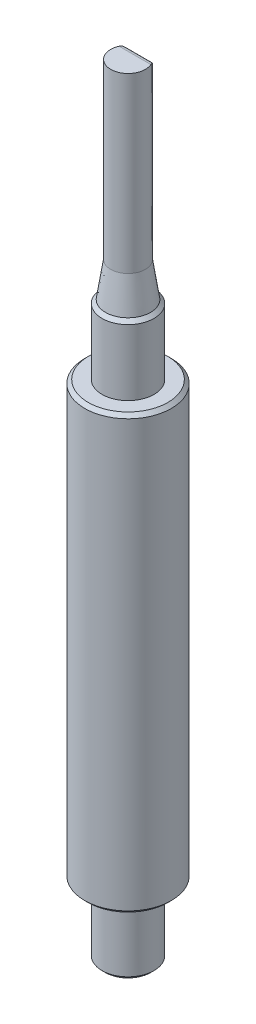
ISO-10303-21;
HEADER;
FILE_DESCRIPTION(('STEP AP214'),'2;1');
FILE_NAME('part.step','',(''),(''),'','','');
FILE_SCHEMA(('AUTOMOTIVE_DESIGN { 1 0 10303 214 1 1 1 1 }'));
ENDSEC;
DATA;
#1=APPLICATION_CONTEXT('core data for automotive mechanical design processes');
#2=APPLICATION_PROTOCOL_DEFINITION('international standard','automotive_design',2000,#1);
#3=PRODUCT_CONTEXT('',#1,'mechanical');
#4=PRODUCT('Part','Part','',(#3));
#5=PRODUCT_RELATED_PRODUCT_CATEGORY('part','',(#4));
#6=PRODUCT_DEFINITION_FORMATION('','',#4);
#7=PRODUCT_DEFINITION_CONTEXT('part definition',#1,'design');
#8=PRODUCT_DEFINITION('design','',#6,#7);
#9=PRODUCT_DEFINITION_SHAPE('','',#8);
#10=(LENGTH_UNIT() NAMED_UNIT(*) SI_UNIT(.MILLI.,.METRE.));
#11=(NAMED_UNIT(*) PLANE_ANGLE_UNIT() SI_UNIT($,.RADIAN.));
#12=(NAMED_UNIT(*) SI_UNIT($,.STERADIAN.) SOLID_ANGLE_UNIT());
#13=UNCERTAINTY_MEASURE_WITH_UNIT(LENGTH_MEASURE(1.E-05),#10,'distance_accuracy_value','');
#14=(GEOMETRIC_REPRESENTATION_CONTEXT(3) GLOBAL_UNCERTAINTY_ASSIGNED_CONTEXT((#13)) GLOBAL_UNIT_ASSIGNED_CONTEXT((#10,
#11,#12)) REPRESENTATION_CONTEXT('',''));
#15=CARTESIAN_POINT('',(0.,0.,0.));
#16=DIRECTION('',(0.,0.,1.));
#17=DIRECTION('',(1.,0.,0.));
#18=AXIS2_PLACEMENT_3D('',#15,#16,#17);
#19=CARTESIAN_POINT('',(0.607071421427142,44.7,-0.4));
#20=DIRECTION('',(-1.,0.,0.));
#21=DIRECTION('',(0.,0.,1.));
#22=AXIS2_PLACEMENT_3D('',#19,#20,#21);
#23=CYLINDRICAL_SURFACE('',#22,0.3);
#24=CARTESIAN_POINT('',(-0.574456264653804,44.7,-0.4));
#25=DIRECTION('',(-0.707106781186547,-0.707106781186547,0.));
#26=DIRECTION('',(-0.707106781186547,0.707106781186547,0.));
#27=AXIS2_PLACEMENT_3D('',#24,#25,#26);
#28=ELLIPSE('',#27,0.424264068711929,0.3);
#29=CARTESIAN_POINT('',(-0.574456264653804,44.7,-0.7));
#30=VERTEX_POINT('',#29);
#31=CARTESIAN_POINT('',(-0.820651806648291,44.9461955419945,-0.571428571428572));
#32=VERTEX_POINT('',#31);
#33=EDGE_CURVE('E89',#30,#32,#28,.F.);
#34=ORIENTED_EDGE('',*,*,#33,.T.);
#35=CARTESIAN_POINT('',(-0.82065180664829,44.9461955419945,-0.571428571428573));
#36=CARTESIAN_POINT('',(-0.831486791364245,44.957002513131,-0.55590412455492));
#37=CARTESIAN_POINT('',(-0.842347326963717,44.966363193244,-0.53933173016223));
#38=CARTESIAN_POINT('',(-0.863396925369178,44.9816760073755,-0.504908323623215));
#39=CARTESIAN_POINT('',(-0.87359575451474,44.9877027880564,-0.487096313962125));
#40=CARTESIAN_POINT('',(-0.889208032027688,44.9946201940011,-0.457674206622167));
#41=CARTESIAN_POINT('',(-0.894893023604096,44.9966019336071,-0.446458954407247));
#42=CARTESIAN_POINT('',(-0.905969974280832,44.9993012746265,-0.423536742781219));
#43=CARTESIAN_POINT('',(-0.911356598671261,45.0000004463388,-0.411825052205996));
#44=CARTESIAN_POINT('',(-0.91651513899117,45.,-0.399999999999999));
#45=B_SPLINE_CURVE_WITH_KNOTS('',3,(#35,#36,#37,#38,#39,#40,#41,#42,#43,#44),.UNSPECIFIED.,.F.,
.F.,(4,2,2,2,4),(0.,0.0653980000322879,0.129265417872378,0.167383420410044,0.206044988795783),.UNSPECIFIED.);
#46=CARTESIAN_POINT('',(-0.916515138991169,45.,-0.4));
#47=VERTEX_POINT('',#46);
#48=EDGE_CURVE('E232',#32,#47,#45,.T.);
#49=ORIENTED_EDGE('',*,*,#48,.T.);
#50=DIRECTION('',(1.,0.,0.));
#51=VECTOR('',#50,1.);
#52=CARTESIAN_POINT('',(0.5,45.,-0.4));
#53=LINE('',#52,#51);
#54=CARTESIAN_POINT('',(0.916515138991169,45.,-0.4));
#55=VERTEX_POINT('',#54);
#56=EDGE_CURVE('E87',#55,#47,#53,.F.);
#57=ORIENTED_EDGE('',*,*,#56,.F.);
#58=CARTESIAN_POINT('',(0.916515138991169,45.,-0.4));
#59=CARTESIAN_POINT('',(0.908195086414317,45.0000007085254,-0.419116854794531));
#60=CARTESIAN_POINT('',(0.899256381457367,44.9981757051321,-0.43791625730455));
#61=CARTESIAN_POINT('',(0.880720408199246,44.9912847616856,-0.474050473040774));
#62=CARTESIAN_POINT('',(0.871141691516868,44.986290173126,-0.491408247359223));
#63=CARTESIAN_POINT('',(0.854733564647568,44.9755503118785,-0.519231442258692));
#64=CARTESIAN_POINT('',(0.848034320922981,44.9705902211016,-0.530088326556315));
#65=CARTESIAN_POINT('',(0.834438006749294,44.9593628267419,-0.551247375362344));
#66=CARTESIAN_POINT('',(0.827539475983611,44.9530771452777,-0.56153886299682));
#67=CARTESIAN_POINT('',(0.820651806648439,44.9461955419946,-0.5714285714287));
#68=B_SPLINE_CURVE_WITH_KNOTS('',3,(#58,#59,#60,#61,#62,#63,#64,#65,#66,#67),.UNSPECIFIED.,.F.,
.F.,(4,2,2,2,4),(0.,0.0623992990006196,0.123441454954557,0.164437245015623,0.206043928930964),.UNSPECIFIED.);
#69=CARTESIAN_POINT('',(0.820651806648364,44.9461955419945,-0.571428571428637));
#70=VERTEX_POINT('',#69);
#71=EDGE_CURVE('E23',#55,#70,#68,.T.);
#72=ORIENTED_EDGE('',*,*,#71,.T.);
#73=CARTESIAN_POINT('',(0.574456264653804,44.7,-0.4));
#74=DIRECTION('',(-0.707106781186547,0.707106781186547,0.));
#75=DIRECTION('',(0.707106781186547,0.707106781186547,0.));
#76=AXIS2_PLACEMENT_3D('',#73,#74,#75);
#77=ELLIPSE('',#76,0.424264068711929,0.3);
#78=CARTESIAN_POINT('',(0.574456246203379,44.6999999815496,-0.699999999999999));
#79=VERTEX_POINT('',#78);
#80=EDGE_CURVE('E84',#79,#70,#77,.F.);
#81=ORIENTED_EDGE('',*,*,#80,.F.);
#82=DIRECTION('',(1.,0.,0.));
#83=VECTOR('',#82,1.);
#84=CARTESIAN_POINT('',(0.714142842854285,44.7,-0.7));
#85=LINE('',#84,#83);
#86=EDGE_CURVE('E225',#79,#30,#85,.F.);
#87=ORIENTED_EDGE('',*,*,#86,.T.);
#88=EDGE_LOOP('',(#34,#49,#57,#72,#81,#87));
#89=FACE_BOUND('',#88,.T.);
#90=ADVANCED_FACE('F16',(#89),#23,.T.);
#91=CARTESIAN_POINT('',(0.714142842854285,45.,-0.7));
#92=DIRECTION('',(0.,0.,1.));
#93=DIRECTION('',(1.,0.,0.));
#94=AXIS2_PLACEMENT_3D('',#91,#92,#93);
#95=PLANE('',#94);
#96=DIRECTION('',(0.,1.,0.));
#97=VECTOR('',#96,1.);
#98=CARTESIAN_POINT('',(-0.574456264653804,45.,-0.7));
#99=LINE('',#98,#97);
#100=CARTESIAN_POINT('',(-0.574456260458789,36.2579002148001,-0.7));
#101=VERTEX_POINT('',#100);
#102=EDGE_CURVE('E286',#30,#101,#99,.F.);
#103=ORIENTED_EDGE('',*,*,#102,.F.);
#104=ORIENTED_EDGE('',*,*,#86,.F.);
#105=DIRECTION('',(0.,1.,0.));
#106=VECTOR('',#105,1.);
#107=CARTESIAN_POINT('',(0.574456227752953,39.,-0.699999999999998));
#108=LINE('',#107,#106);
#109=CARTESIAN_POINT('',(0.574456231750478,36.2579002273013,-0.699999999999999));
#110=VERTEX_POINT('',#109);
#111=EDGE_CURVE('E97',#110,#79,#108,.T.);
#112=ORIENTED_EDGE('',*,*,#111,.F.);
#113=CARTESIAN_POINT('',(-0.574456256105253,36.2579002137249,-0.7));
#114=CARTESIAN_POINT('',(-0.415607185223692,36.3049201819111,-0.7));
#115=CARTESIAN_POINT('',(-0.135920532221662,36.2980420531235,-0.7));
#116=CARTESIAN_POINT('',(0.246852929939482,36.3032446765331,-0.7));
#117=CARTESIAN_POINT('',(0.468950805976639,36.2891302485885,-0.7));
#118=CARTESIAN_POINT('',(0.574456224780227,36.2579002229972,-0.7));
#119=B_SPLINE_CURVE_WITH_KNOTS('',3,(#113,#114,#115,#116,#117,#118),.UNSPECIFIED.,.F.,.F.,(4,1,
1,4),(-0.443713924987909,-0.394237606955045,-0.361253394933135,-0.328269182911225),.UNSPECIFIED.);
#120=EDGE_CURVE('E221',#101,#110,#119,.T.);
#121=ORIENTED_EDGE('',*,*,#120,.F.);
#122=EDGE_LOOP('',(#103,#104,#112,#121));
#123=FACE_BOUND('',#122,.T.);
#124=ADVANCED_FACE('F145',(#123),#95,.F.);
#125=CARTESIAN_POINT('',(0.498116728140827,36.,-0.867109984457726));
#126=CARTESIAN_POINT('',(0.628796296571906,36.,-0.7920402929209));
#127=CARTESIAN_POINT('',(0.737312217295038,35.9999999999996,-0.690447275014311));
#128=CARTESIAN_POINT('',(0.819649848959591,36.,-0.572865529033029));
#129=CARTESIAN_POINT('',(0.820151372921416,36.,-0.572147264652189));
#130=CARTESIAN_POINT('',(0.820651806648291,36.,-0.571428571428571));
#131=CARTESIAN_POINT('',(0.506105038292124,36.0269871540351,-0.810146964408643));
#132=CARTESIAN_POINT('',(0.625246272822953,36.0374169518373,-0.762285643172855));
#133=CARTESIAN_POINT('',(0.743000606769367,36.018690427441,-0.683002406925967));
#134=CARTESIAN_POINT('',(0.819714913519432,36.0002249787862,-0.57276680575976));
#135=CARTESIAN_POINT('',(0.820184735169876,36.0001125203346,-0.572099351770612));
#136=CARTESIAN_POINT('',(0.820651806648291,36.,-0.571428571428571));
#137=CARTESIAN_POINT('',(0.529353826091413,36.1055292679072,-0.726931385835004));
#138=CARTESIAN_POINT('',(0.630443369815318,36.1043263734683,-0.723477006918424));
#139=CARTESIAN_POINT('',(0.752893461672539,36.0511330666152,-0.669290030782527));
#140=CARTESIAN_POINT('',(0.819829870096403,36.0006198259131,-0.572597556636266));
#141=CARTESIAN_POINT('',(0.820243119104681,36.0003094309202,-0.572015504227852));
#142=CARTESIAN_POINT('',(0.820651806648291,36.,-0.571428571428571));
#143=CARTESIAN_POINT('',(0.560931007372592,36.2122074757662,-0.699999999101168));
#144=CARTESIAN_POINT('',(0.658682787101775,36.1702674571997,-0.704587869809925));
#145=CARTESIAN_POINT('',(0.762380665204807,36.0837481957669,-0.654975992715992));
#146=CARTESIAN_POINT('',(0.819948040521739,36.0010139456431,-0.57243195003714));
#147=CARTESIAN_POINT('',(0.820301503039487,36.0005063415058,-0.571931656685092));
#148=CARTESIAN_POINT('',(0.820651806648291,36.,-0.571428571428571));
#149=CARTESIAN_POINT('',(0.574456244717016,36.2579002229972,-0.7));
#150=CARTESIAN_POINT('',(0.67467641849957,36.1985690722457,-0.700000006660228));
#151=CARTESIAN_POINT('',(0.766410972965412,36.0977260025416,-0.648719170601916));
#152=CARTESIAN_POINT('',(0.819999106318638,36.0011828552056,-0.572361689184687));
#153=CARTESIAN_POINT('',(0.820326524725832,36.0005907317568,-0.571895722023909));
#154=CARTESIAN_POINT('',(0.820651806648291,36.,-0.571428571428571));
#155=B_SPLINE_SURFACE_WITH_KNOTS('',3,3,((#125,#126,#127,#128,#129,#130),(#131,#132,#133,#134,
#135,#136),(#137,#138,#139,#140,#141,#142),(#143,#144,#145,#146,#147,#148),(#149,#150,#151,#152,
#153,#154)),.UNSPECIFIED.,.F.,.F.,.F.,(4,1,4),(4,2,4),(0.,0.571428571428571,1.),
(-0.062711136605368,0.,0.000384786231061),.UNSPECIFIED.);
#156=CARTESIAN_POINT('',(0.574456244717016,36.2579002229972,-0.7));
#157=CARTESIAN_POINT('',(0.67467641849957,36.1985690722457,-0.700000006660228));
#158=CARTESIAN_POINT('',(0.766410972965412,36.0977260025416,-0.648719170601916));
#159=CARTESIAN_POINT('',(0.819999106318638,36.0011828552056,-0.572361689184687));
#160=CARTESIAN_POINT('',(0.820326524725832,36.0005907317568,-0.571895722023909));
#161=CARTESIAN_POINT('',(0.820651806648291,36.,-0.571428571428571));
#162=B_SPLINE_CURVE_WITH_KNOTS('',3,(#156,#157,#158,#159,#160,#161),.UNSPECIFIED.,.F.,.F.,(4,2,
4),(-0.062711136605368,0.,0.000384786231061),.UNSPECIFIED.);
#163=CARTESIAN_POINT('',(0.820651806648291,36.,-0.571428571428572));
#164=VERTEX_POINT('',#163);
#165=EDGE_CURVE('E157',#164,#110,#162,.F.);
#166=CARTESIAN_POINT('',(0.820651806648291,36.,-0.571428571428571));
#167=CARTESIAN_POINT('',(0.810375051235391,35.9999999999999,-0.586187313590142));
#168=CARTESIAN_POINT('',(0.799698689093445,35.9999999999998,-0.600667625086037));
#169=CARTESIAN_POINT('',(0.777523173814304,35.9999999999996,-0.62910540120493));
#170=CARTESIAN_POINT('',(0.766020027319212,35.9999999999995,-0.643059752132622));
#171=CARTESIAN_POINT('',(0.742208567337317,35.9999999999994,-0.670401458845179));
#172=CARTESIAN_POINT('',(0.729896106658708,35.9999999999993,-0.68378520292316));
#173=CARTESIAN_POINT('',(0.704484130169668,35.9999999999992,-0.709941532439052));
#174=CARTESIAN_POINT('',(0.691380300681094,35.9999999999992,-0.72270992726356));
#175=CARTESIAN_POINT('',(0.664403656687391,35.9999999999991,-0.747591397280059));
#176=CARTESIAN_POINT('',(0.650526330692965,35.9999999999991,-0.759699581503383));
#177=CARTESIAN_POINT('',(0.6220208555746,35.9999999999991,-0.783216687120971));
#178=CARTESIAN_POINT('',(0.607387973492374,35.9999999999991,-0.794619872270608));
#179=CARTESIAN_POINT('',(0.577389389795204,35.9999999999991,-0.816682891700919));
#180=CARTESIAN_POINT('',(0.562018720794316,35.9999999999991,-0.827335972369576));
#181=CARTESIAN_POINT('',(0.53056323884877,35.9999999999991,-0.847855944950029));
#182=CARTESIAN_POINT('',(0.514473236873227,35.9999999999992,-0.857714883142056));
#183=CARTESIAN_POINT('',(0.498116728140595,35.9999999999992,-0.867109984459381));
#184=B_SPLINE_CURVE_WITH_KNOTS('',3,(#166,#167,#168,#169,#170,#171,#172,#173,#174,#175,#176,
#177,#178,#179,#180,#181,#182,#183),.UNSPECIFIED.,.F.,.F.,(4,2,2,2,2,2,2,2,4),(0.,
0.0539459018489974,0.108172590224629,0.162702867504842,0.217563280429248,0.272786415734586,
0.328411821230984,0.384486851743178,0.441067424441955),.UNSPECIFIED.);
#185=CARTESIAN_POINT('',(0.498116728140827,36.,-0.867109984457727));
#186=VERTEX_POINT('',#185);
#187=EDGE_CURVE('E103',#186,#164,#184,.F.);
#188=CARTESIAN_POINT('',(0.574456224780227,36.2579002229972,-0.7));
#189=CARTESIAN_POINT('',(0.558676783157804,36.2045920183019,-0.7));
#190=CARTESIAN_POINT('',(0.527147844460233,36.0980767715564,-0.731733553487537));
#191=CARTESIAN_POINT('',(0.505106495615667,36.0236137605017,-0.817267342760314));
#192=CARTESIAN_POINT('',(0.498116728140827,36.,-0.867109984457727));
#193=CARTESIAN_POINT('',(0.49797693279133,35.99952772479,-0.868106837291675));
#194=CARTESIAN_POINT('',(0.497837137441833,35.9990554495799,-0.869103690125624));
#195=CARTESIAN_POINT('',(0.497697342092337,35.9985831743699,-0.870100542959572));
#196=B_SPLINE_CURVE_WITH_KNOTS('',3,(#188,#189,#190,#191,#192,#193,#194,#195),.UNSPECIFIED.,.F.,
.F.,(4,1,3,4),(-0.01,0.49,0.99,1.),.UNSPECIFIED.);
#197=EDGE_CURVE('E493',#110,#186,#196,.T.);
#198=ORIENTED_EDGE('',*,*,#165,.F.);
#199=ORIENTED_EDGE('',*,*,#187,.F.);
#200=ORIENTED_EDGE('',*,*,#197,.F.);
#201=EDGE_LOOP('',(#198,#199,#200));
#202=FACE_BOUND('',#201,.T.);
#203=ADVANCED_FACE('F144',(#202),#155,.T.);
#204=CARTESIAN_POINT('',(0.574456264653804,39.,-0.4));
#205=DIRECTION('',(0.,1.,0.));
#206=DIRECTION('',(0.,0.,1.));
#207=AXIS2_PLACEMENT_3D('',#204,#205,#206);
#208=CYLINDRICAL_SURFACE('',#207,0.3);
#209=ORIENTED_EDGE('',*,*,#80,.T.);
#210=DIRECTION('',(0.,-1.,0.));
#211=VECTOR('',#210,1.);
#212=CARTESIAN_POINT('',(0.820651806648291,39.,-0.571428571428572));
#213=LINE('',#212,#211);
#214=EDGE_CURVE('E94',#164,#70,#213,.F.);
#215=ORIENTED_EDGE('',*,*,#214,.F.);
#216=ORIENTED_EDGE('',*,*,#165,.T.);
#217=ORIENTED_EDGE('',*,*,#111,.T.);
#218=EDGE_LOOP('',(#209,#215,#216,#217));
#219=FACE_BOUND('',#218,.T.);
#220=ADVANCED_FACE('F92',(#219),#208,.T.);
#221=CARTESIAN_POINT('',(0.5,45.,0.));
#222=DIRECTION('',(0.,1.,0.));
#223=DIRECTION('',(0.,0.,1.));
#224=AXIS2_PLACEMENT_3D('',#221,#222,#223);
#225=PLANE('',#224);
#226=ORIENTED_EDGE('',*,*,#56,.T.);
#227=CARTESIAN_POINT('',(0.,45.,0.));
#228=DIRECTION('',(0.,-1.,0.));
#229=DIRECTION('',(0.,0.,-1.));
#230=AXIS2_PLACEMENT_3D('',#227,#228,#229);
#231=CIRCLE('',#230,1.);
#232=EDGE_CURVE('E105',#55,#47,#231,.T.);
#233=ORIENTED_EDGE('',*,*,#232,.F.);
#234=EDGE_LOOP('',(#226,#233));
#235=FACE_BOUND('',#234,.T.);
#236=ADVANCED_FACE('F135',(#235),#225,.T.);
#237=CARTESIAN_POINT('',(-0.574456264653804,39.,-0.4));
#238=DIRECTION('',(0.,-1.,0.));
#239=DIRECTION('',(0.,0.,-1.));
#240=AXIS2_PLACEMENT_3D('',#237,#238,#239);
#241=CYLINDRICAL_SURFACE('',#240,0.3);
#242=ORIENTED_EDGE('',*,*,#33,.F.);
#243=ORIENTED_EDGE('',*,*,#102,.T.);
#244=CARTESIAN_POINT('',(-0.820651806648291,36.,-0.571428571428571));
#245=CARTESIAN_POINT('',(-0.820326524725774,36.0005907317568,-0.571895722024002));
#246=CARTESIAN_POINT('',(-0.819999106318773,36.0011828552052,-0.572361689184862));
#247=CARTESIAN_POINT('',(-0.766410975663694,36.0977259976713,-0.648719166669538));
#248=CARTESIAN_POINT('',(-0.674676428277698,36.1985690612339,-0.700000001429236));
#249=CARTESIAN_POINT('',(-0.574456260376288,36.2579002137139,-0.7));
#250=B_SPLINE_CURVE_WITH_KNOTS('',3,(#244,#245,#246,#247,#248,#249),.UNSPECIFIED.,.F.,.F.,(4,2,
4),(-0.284132986515438,-0.283748200284363,-0.221037066914742),.UNSPECIFIED.);
#251=CARTESIAN_POINT('',(-0.820651806648291,36.,-0.571428571428571));
#252=VERTEX_POINT('',#251);
#253=EDGE_CURVE('E119',#252,#101,#250,.T.);
#254=ORIENTED_EDGE('',*,*,#253,.F.);
#255=DIRECTION('',(0.,-1.,0.));
#256=VECTOR('',#255,1.);
#257=CARTESIAN_POINT('',(-0.820651806648291,39.,-0.571428571428571));
#258=LINE('',#257,#256);
#259=EDGE_CURVE('E107',#32,#252,#258,.T.);
#260=ORIENTED_EDGE('',*,*,#259,.F.);
#261=EDGE_LOOP('',(#242,#243,#254,#260));
#262=FACE_BOUND('',#261,.T.);
#263=ADVANCED_FACE('F125',(#262),#241,.T.);
#264=CARTESIAN_POINT('',(-0.820651806648291,36.,-0.571428571428571));
#265=CARTESIAN_POINT('',(-0.820151372921344,36.,-0.572147264652293));
#266=CARTESIAN_POINT('',(-0.819649848959633,36.,-0.572865529033077));
#267=CARTESIAN_POINT('',(-0.737312221488417,36.,-0.690447269000332));
#268=CARTESIAN_POINT('',(-0.628796307941691,36.,-0.792040282295915));
#269=CARTESIAN_POINT('',(-0.498116748563567,36.,-0.867109972725756));
#270=CARTESIAN_POINT('',(-0.820651806648291,36.,-0.571428571428571));
#271=CARTESIAN_POINT('',(-0.820242360343848,36.0001933622534,-0.572132338311484));
#272=CARTESIAN_POINT('',(-0.819733526102989,36.0003971543431,-0.572629795465115));
#273=CARTESIAN_POINT('',(-0.748042059456811,36.0326421525868,-0.678600374541067));
#274=CARTESIAN_POINT('',(-0.623554872209963,36.0651372192092,-0.743059813170926));
#275=CARTESIAN_POINT('',(-0.512096288172223,36.0472275223307,-0.767424695027433));
#276=CARTESIAN_POINT('',(-0.820651806648291,36.,-0.571428571428571));
#277=CARTESIAN_POINT('',(-0.820299279763126,36.0003999993943,-0.572030958707414));
#278=CARTESIAN_POINT('',(-0.819851166368079,36.000783279435,-0.572478545195849));
#279=CARTESIAN_POINT('',(-0.757675514541241,36.0650840417688,-0.66427920992229));
#280=CARTESIAN_POINT('',(-0.638493782598771,36.1332831335063,-0.713049061706252));
#281=CARTESIAN_POINT('',(-0.542897372351122,36.1512838098774,-0.699999999550362));
#282=CARTESIAN_POINT('',(-0.820651806648291,36.,-0.571428571428571));
#283=CARTESIAN_POINT('',(-0.820326524725777,36.0005907317569,-0.571895722023988));
#284=CARTESIAN_POINT('',(-0.819999106318788,36.0011828552053,-0.57236168918485));
#285=CARTESIAN_POINT('',(-0.766410975664591,36.0977259976746,-0.64871916666794));
#286=CARTESIAN_POINT('',(-0.674676428281414,36.1985690612406,-0.700000001427896));
#287=CARTESIAN_POINT('',(-0.574456260379529,36.2579002137249,-0.7));
#288=B_SPLINE_SURFACE_WITH_KNOTS('',3,3,((#264,#265,#266,#267,#268,#269),(#270,#271,#272,#273,
#274,#275),(#276,#277,#278,#279,#280,#281),(#282,#283,#284,#285,#286,#287)),.UNSPECIFIED.,.F.,
.F.,.F.,(4,4),(4,2,4),(0.,1.),(-0.284132986515438,-0.283748200284363,-0.221037066914742),.UNSPECIFIED.);
#289=CARTESIAN_POINT('',(-0.820651806648291,36.,-0.571428571428571));
#290=CARTESIAN_POINT('',(-0.820151372921344,36.,-0.572147264652293));
#291=CARTESIAN_POINT('',(-0.819649848959633,36.,-0.572865529033077));
#292=CARTESIAN_POINT('',(-0.737312221488417,36.,-0.690447269000332));
#293=CARTESIAN_POINT('',(-0.628796307941691,36.,-0.792040282295915));
#294=CARTESIAN_POINT('',(-0.498116748563567,36.,-0.867109972725756));
#295=B_SPLINE_CURVE_WITH_KNOTS('',3,(#289,#290,#291,#292,#293,#294),.UNSPECIFIED.,.F.,.F.,(4,2,
4),(-0.284132986515438,-0.283748200284363,-0.221037066914742),.UNSPECIFIED.);
#296=CARTESIAN_POINT('',(-0.498116748563567,36.,-0.867109972725757));
#297=VERTEX_POINT('',#296);
#298=EDGE_CURVE('E272',#252,#297,#295,.T.);
#299=CARTESIAN_POINT('',(-0.497697362425571,35.9985831743208,-0.87010053104583));
#300=CARTESIAN_POINT('',(-0.497837157804903,35.9990554495472,-0.869103678272472));
#301=CARTESIAN_POINT('',(-0.497976953184234,35.9995277247736,-0.868106825499115));
#302=CARTESIAN_POINT('',(-0.498116748563566,36.,-0.867109972725757));
#303=CARTESIAN_POINT('',(-0.505106517530151,36.0236137613199,-0.817267334057871));
#304=CARTESIAN_POINT('',(-0.527147869860398,36.098076770839,-0.731733550931639));
#305=CARTESIAN_POINT('',(-0.55867681250827,36.2045920118885,-0.7));
#306=CARTESIAN_POINT('',(-0.574456256105253,36.2579002137249,-0.7));
#307=B_SPLINE_CURVE_WITH_KNOTS('',3,(#299,#300,#301,#302,#303,#304,#305,#306),.UNSPECIFIED.,.F.,
.F.,(4,3,1,4),(-0.01,0.,0.5,1.),.UNSPECIFIED.);
#308=EDGE_CURVE('E43',#297,#101,#307,.T.);
#309=ORIENTED_EDGE('',*,*,#298,.F.);
#310=ORIENTED_EDGE('',*,*,#253,.T.);
#311=ORIENTED_EDGE('',*,*,#308,.F.);
#312=EDGE_LOOP('',(#309,#310,#311));
#313=FACE_BOUND('',#312,.T.);
#314=ADVANCED_FACE('F134',(#313),#288,.T.);
#315=CARTESIAN_POINT('',(-0.497697362425571,35.9985831743208,-0.87010053104583));
#316=CARTESIAN_POINT('',(-0.394587854626773,35.9988396622432,-0.930517986143591));
#317=CARTESIAN_POINT('',(-0.143490802667709,36.0003980468925,-1.02572682747101));
#318=CARTESIAN_POINT('',(0.25371966033372,35.999756904333,-0.989899362213132));
#319=CARTESIAN_POINT('',(0.429213389414775,35.9987535302641,-0.910229004375584));
#320=CARTESIAN_POINT('',(0.497697342092337,35.9985831743699,-0.870100542959572));
#321=CARTESIAN_POINT('',(-0.497837157804903,35.9990554495472,-0.869103678272472));
#322=CARTESIAN_POINT('',(-0.394576279288216,35.9992264414955,-0.929212904799846));
#323=CARTESIAN_POINT('',(-0.143483895318918,36.000265364595,-1.02409322383108));
#324=CARTESIAN_POINT('',(0.253717574872341,35.999837936222,-0.988374785386946));
#325=CARTESIAN_POINT('',(0.429252646381068,35.9991690201761,-0.909027430274085));
#326=CARTESIAN_POINT('',(0.497837137441833,35.9990554495799,-0.869103690125624));
#327=CARTESIAN_POINT('',(-0.497976953184234,35.9995277247736,-0.868106825499115));
#328=CARTESIAN_POINT('',(-0.39456470394966,35.9996132207477,-0.927907823456101));
#329=CARTESIAN_POINT('',(-0.143476987970128,36.0001326822975,-1.02245962019116));
#330=CARTESIAN_POINT('',(0.253715489410963,35.999918968111,-0.986850208560759));
#331=CARTESIAN_POINT('',(0.429291903347362,35.999584510088,-0.907825856172586));
#332=CARTESIAN_POINT('',(0.49797693279133,35.99952772479,-0.868106837291675));
#333=CARTESIAN_POINT('',(-0.498116748563566,36.,-0.867109972725757));
#334=CARTESIAN_POINT('',(-0.394553128611103,36.,-0.926602742112356));
#335=CARTESIAN_POINT('',(-0.143470080621337,36.,-1.02082601655123));
#336=CARTESIAN_POINT('',(0.253713403949584,36.,-0.985325631734573));
#337=CARTESIAN_POINT('',(0.429331160313655,36.,-0.906624282071088));
#338=CARTESIAN_POINT('',(0.498116728140827,36.,-0.867109984457727));
#339=CARTESIAN_POINT('',(-0.505106517530151,36.0236137613199,-0.817267334057871));
#340=CARTESIAN_POINT('',(-0.393974361683277,36.0193389626139,-0.861348674925109));
#341=CARTESIAN_POINT('',(-0.1431247131818,35.9933658851245,-0.939145834554866));
#342=CARTESIAN_POINT('',(0.253609130880648,36.0040515944505,-0.909096790425253));
#343=CARTESIAN_POINT('',(0.43129400862832,36.0207744955983,-0.846545576996163));
#344=CARTESIAN_POINT('',(0.505106495615667,36.0236137605017,-0.817267342760314));
#345=CARTESIAN_POINT('',(-0.527147869860398,36.098076770839,-0.731733550931639));
#346=CARTESIAN_POINT('',(-0.398345760348023,36.1017721727383,-0.744760813096671));
#347=CARTESIAN_POINT('',(-0.141148964444887,36.0535119724048,-0.771615945439365));
#348=CARTESIAN_POINT('',(0.251917924053382,36.0742290758572,-0.760891630840957));
#349=CARTESIAN_POINT('',(0.441599212717529,36.1005312047833,-0.740386086071389));
#350=CARTESIAN_POINT('',(0.527147844460233,36.0980767715564,-0.731733553487537));
#351=CARTESIAN_POINT('',(-0.55867681250827,36.2045920118885,-0.7));
#352=CARTESIAN_POINT('',(-0.409839388321454,36.2370890438027,-0.69987483385831));
#353=CARTESIAN_POINT('',(-0.137659669205637,36.2159959232818,-0.699401979247465));
#354=CARTESIAN_POINT('',(0.248549885196874,36.2265632408605,-0.699609309474116));
#355=CARTESIAN_POINT('',(0.459820965250669,36.2261761055627,-0.699916866323228));
#356=CARTESIAN_POINT('',(0.558676783157804,36.2045920183019,-0.7));
#357=CARTESIAN_POINT('',(-0.574456256105253,36.2579002137249,-0.7));
#358=CARTESIAN_POINT('',(-0.415607185223692,36.3049201819111,-0.7));
#359=CARTESIAN_POINT('',(-0.135920532221662,36.2980420531235,-0.7));
#360=CARTESIAN_POINT('',(0.246852929939482,36.3032446765331,-0.7));
#361=CARTESIAN_POINT('',(0.468950805976639,36.2891302485885,-0.7));
#362=CARTESIAN_POINT('',(0.574456224780227,36.2579002229972,-0.7));
#363=B_SPLINE_SURFACE_WITH_KNOTS('',3,3,((#315,#316,#317,#318,#319,#320),(#321,#322,#323,#324,
#325,#326),(#327,#328,#329,#330,#331,#332),(#333,#334,#335,#336,#337,#338),(#339,#340,#341,#342,
#343,#344),(#345,#346,#347,#348,#349,#350),(#351,#352,#353,#354,#355,#356),(#357,#358,#359,#360,
#361,#362)),.UNSPECIFIED.,.F.,.F.,.F.,(4,3,1,4),(4,1,1,4),(-0.01,0.,0.5,1.),(-0.443713924987909,
-0.394237606955045,-0.361253394933135,-0.328269182911225),.UNSPECIFIED.);
#364=CARTESIAN_POINT('',(-0.498116748563566,36.,-0.867109972725757));
#365=CARTESIAN_POINT('',(-0.477945514204119,35.9999595163126,-0.878697757999477));
#366=CARTESIAN_POINT('',(-0.457375260510356,35.9999107309094,-0.889577778259119));
#367=CARTESIAN_POINT('',(-0.415529869714726,35.9998301449211,-0.909876759540828));
#368=CARTESIAN_POINT('',(-0.394254839220164,35.9997983417796,-0.919295940321567));
#369=CARTESIAN_POINT('',(-0.329509653713946,35.9997787453576,-0.945296187118675));
#370=CARTESIAN_POINT('',(-0.285113096111442,35.9998667317186,-0.959623576726632));
#371=CARTESIAN_POINT('',(-0.18536577386284,35.9999841798359,-0.984275271212266));
#372=CARTESIAN_POINT('',(-0.129654096820941,35.9999977025538,-0.993151338355016));
#373=CARTESIAN_POINT('',(-0.0175029128870166,36.0000021752858,-1.00142751833463));
#374=CARTESIAN_POINT('',(0.0389369928382982,35.9999931123586,-1.00082219741324));
#375=CARTESIAN_POINT('',(0.150943065989278,36.0000017800907,-0.990143790854018));
#376=CARTESIAN_POINT('',(0.206508716494985,36.0000195260411,-0.98006530321838));
#377=CARTESIAN_POINT('',(0.315079918808837,36.0000241032698,-0.950723480102604));
#378=CARTESIAN_POINT('',(0.368089603998226,36.0000109862949,-0.93147556183844));
#379=CARTESIAN_POINT('',(0.446028803673925,35.999999777814,-0.89551551388917));
#380=CARTESIAN_POINT('',(0.472412646086553,35.9999975177703,-0.881887356828183));
#381=CARTESIAN_POINT('',(0.498116728140827,36.,-0.867109984457727));
#382=B_SPLINE_CURVE_WITH_KNOTS('',3,(#364,#365,#366,#367,#368,#369,#370,#371,#372,#373,#374,
#375,#376,#377,#378,#379,#380,#381),.UNSPECIFIED.,.F.,.F.,(4,2,2,2,2,2,2,2,4),(0.,
0.0697611672976007,0.13951183000318,0.27899153071142,0.447423278016275,0.61595155663711,
0.784575995506017,0.952917909430909,1.04188069338723),.UNSPECIFIED.);
#383=EDGE_CURVE('E269',#297,#186,#382,.T.);
#384=ORIENTED_EDGE('',*,*,#308,.T.);
#385=ORIENTED_EDGE('',*,*,#120,.T.);
#386=ORIENTED_EDGE('',*,*,#197,.T.);
#387=ORIENTED_EDGE('',*,*,#383,.F.);
#388=EDGE_LOOP('',(#384,#385,#386,#387));
#389=FACE_BOUND('',#388,.T.);
#390=ADVANCED_FACE('F18',(#389),#363,.T.);
#391=CARTESIAN_POINT('',(0.,39.,0.));
#392=DIRECTION('',(0.,-1.,0.));
#393=DIRECTION('',(0.,0.,-1.));
#394=AXIS2_PLACEMENT_3D('',#391,#392,#393);
#395=CYLINDRICAL_SURFACE('',#394,1.);
#396=ORIENTED_EDGE('',*,*,#298,.T.);
#397=ORIENTED_EDGE('',*,*,#383,.T.);
#398=ORIENTED_EDGE('',*,*,#187,.T.);
#399=ORIENTED_EDGE('',*,*,#214,.T.);
#400=ORIENTED_EDGE('',*,*,#71,.F.);
#401=ORIENTED_EDGE('',*,*,#232,.T.);
#402=ORIENTED_EDGE('',*,*,#48,.F.);
#403=ORIENTED_EDGE('',*,*,#259,.T.);
#404=EDGE_LOOP('',(#396,#397,#398,#399,#400,#401,#402,#403));
#405=FACE_BOUND('',#404,.T.);
#406=CARTESIAN_POINT('',(0.,35.000000000025,0.));
#407=DIRECTION('',(0.,-1.,0.));
#408=DIRECTION('',(-1.,0.,0.));
#409=AXIS2_PLACEMENT_3D('',#406,#407,#408);
#410=CIRCLE('',#409,1.00000000016109);
#411=CARTESIAN_POINT('',(-1.00000000016109,35.000000000025,0.));
#412=VERTEX_POINT('',#411);
#413=EDGE_CURVE('E271',#412,#412,#410,.T.);
#414=ORIENTED_EDGE('',*,*,#413,.F.);
#415=EDGE_LOOP('',(#414));
#416=FACE_BOUND('',#415,.T.);
#417=ADVANCED_FACE('F100',(#405,#416),#395,.T.);
#418=CARTESIAN_POINT('',(0.,32.9999999999586,0.));
#419=DIRECTION('',(0.,-1.,0.));
#420=DIRECTION('',(0.,0.,-1.));
#421=AXIS2_PLACEMENT_3D('',#418,#419,#420);
#422=CONICAL_SURFACE('',#421,1.29999999982999,0.148889947442719);
#423=CARTESIAN_POINT('',(0.,33.0000000000723,0.));
#424=DIRECTION('',(0.,-1.,0.));
#425=DIRECTION('',(-1.,0.,0.));
#426=AXIS2_PLACEMENT_3D('',#423,#424,#425);
#427=CIRCLE('',#426,1.30000000012842);
#428=CARTESIAN_POINT('',(-1.30000000012842,33.0000000000723,0.));
#429=VERTEX_POINT('',#428);
#430=EDGE_CURVE('E268',#429,#429,#427,.T.);
#431=ORIENTED_EDGE('',*,*,#430,.F.);
#432=EDGE_LOOP('',(#431));
#433=FACE_BOUND('',#432,.T.);
#434=ORIENTED_EDGE('',*,*,#413,.T.);
#435=EDGE_LOOP('',(#434));
#436=FACE_BOUND('',#435,.T.);
#437=ADVANCED_FACE('F419',(#433,#436),#422,.T.);
#438=CARTESIAN_POINT('',(0.75,0.,0.));
#439=DIRECTION('',(0.,-1.,0.));
#440=DIRECTION('',(0.,0.,-1.));
#441=AXIS2_PLACEMENT_3D('',#438,#439,#440);
#442=PLANE('',#441);
#443=CARTESIAN_POINT('',(0.,-1.13686837721616E-10,0.));
#444=DIRECTION('',(0.,1.,0.));
#445=DIRECTION('',(0.,0.,1.));
#446=AXIS2_PLACEMENT_3D('',#443,#444,#445);
#447=CIRCLE('',#446,1.30000000007158);
#448=CARTESIAN_POINT('',(0.,-1.13686837721616E-10,1.30000000007158));
#449=VERTEX_POINT('',#448);
#450=EDGE_CURVE('E264',#449,#449,#447,.T.);
#451=ORIENTED_EDGE('',*,*,#450,.F.);
#452=EDGE_LOOP('',(#451));
#453=FACE_BOUND('',#452,.T.);
#454=ADVANCED_FACE('F409',(#453),#442,.T.);
#455=CARTESIAN_POINT('',(0.,32.7999999998951,0.));
#456=DIRECTION('',(0.,-1.,0.));
#457=DIRECTION('',(0.,0.,-1.));
#458=AXIS2_PLACEMENT_3D('',#455,#456,#457);
#459=CONICAL_SURFACE('',#458,1.49999999996453,0.785398162544797);
#460=CARTESIAN_POINT('',(0.,32.8,0.));
#461=DIRECTION('',(0.,-1.,0.));
#462=DIRECTION('',(0.,0.,-1.));
#463=AXIS2_PLACEMENT_3D('',#460,#461,#462);
#464=CIRCLE('',#463,1.5);
#465=CARTESIAN_POINT('',(0.,32.8,-1.5));
#466=VERTEX_POINT('',#465);
#467=EDGE_CURVE('E267',#466,#466,#464,.T.);
#468=ORIENTED_EDGE('',*,*,#467,.F.);
#469=EDGE_LOOP('',(#468));
#470=FACE_BOUND('',#469,.T.);
#471=ORIENTED_EDGE('',*,*,#430,.T.);
#472=EDGE_LOOP('',(#471));
#473=FACE_BOUND('',#472,.T.);
#474=ADVANCED_FACE('F399',(#470,#473),#459,.T.);
#475=CARTESIAN_POINT('',(0.,0.200000000006639,0.));
#476=DIRECTION('',(0.,1.,0.));
#477=DIRECTION('',(0.,0.,1.));
#478=AXIS2_PLACEMENT_3D('',#475,#476,#477);
#479=CONICAL_SURFACE('',#478,1.49999999990769,0.785398162686906);
#480=ORIENTED_EDGE('',*,*,#450,.T.);
#481=EDGE_LOOP('',(#480));
#482=FACE_BOUND('',#481,.T.);
#483=CARTESIAN_POINT('',(0.,0.2,0.));
#484=DIRECTION('',(0.,-1.,0.));
#485=DIRECTION('',(0.,0.,-1.));
#486=AXIS2_PLACEMENT_3D('',#483,#484,#485);
#487=CIRCLE('',#486,1.5);
#488=CARTESIAN_POINT('',(0.,0.2,-1.5));
#489=VERTEX_POINT('',#488);
#490=EDGE_CURVE('E263',#489,#489,#487,.F.);
#491=ORIENTED_EDGE('',*,*,#490,.F.);
#492=EDGE_LOOP('',(#491));
#493=FACE_BOUND('',#492,.T.);
#494=ADVANCED_FACE('F389',(#482,#493),#479,.T.);
#495=CARTESIAN_POINT('',(0.,31.,0.));
#496=DIRECTION('',(0.,-1.,0.));
#497=DIRECTION('',(0.,0.,-1.));
#498=AXIS2_PLACEMENT_3D('',#495,#496,#497);
#499=CYLINDRICAL_SURFACE('',#498,1.5);
#500=ORIENTED_EDGE('',*,*,#467,.T.);
#501=EDGE_LOOP('',(#500));
#502=FACE_BOUND('',#501,.T.);
#503=CARTESIAN_POINT('',(0.,29.,0.));
#504=DIRECTION('',(0.,-1.,0.));
#505=DIRECTION('',(0.,0.,-1.));
#506=AXIS2_PLACEMENT_3D('',#503,#504,#505);
#507=CIRCLE('',#506,1.5);
#508=CARTESIAN_POINT('',(0.,29.,-1.5));
#509=VERTEX_POINT('',#508);
#510=EDGE_CURVE('E260',#509,#509,#507,.T.);
#511=ORIENTED_EDGE('',*,*,#510,.F.);
#512=EDGE_LOOP('',(#511));
#513=FACE_BOUND('',#512,.T.);
#514=ADVANCED_FACE('F340',(#502,#513),#499,.T.);
#515=CARTESIAN_POINT('',(0.,2.,0.));
#516=DIRECTION('',(0.,-1.,0.));
#517=DIRECTION('',(0.,0.,-1.));
#518=AXIS2_PLACEMENT_3D('',#515,#516,#517);
#519=CYLINDRICAL_SURFACE('',#518,1.5);
#520=ORIENTED_EDGE('',*,*,#490,.T.);
#521=EDGE_LOOP('',(#520));
#522=FACE_BOUND('',#521,.T.);
#523=CARTESIAN_POINT('',(0.,4.,0.));
#524=DIRECTION('',(0.,-1.,0.));
#525=DIRECTION('',(0.,0.,-1.));
#526=AXIS2_PLACEMENT_3D('',#523,#524,#525);
#527=CIRCLE('',#526,1.5);
#528=CARTESIAN_POINT('',(0.,4.,-1.5));
#529=VERTEX_POINT('',#528);
#530=EDGE_CURVE('E257',#529,#529,#527,.F.);
#531=ORIENTED_EDGE('',*,*,#530,.F.);
#532=EDGE_LOOP('',(#531));
#533=FACE_BOUND('',#532,.T.);
#534=ADVANCED_FACE('F330',(#522,#533),#519,.T.);
#535=CARTESIAN_POINT('',(2.,29.,0.));
#536=DIRECTION('',(0.,1.,0.));
#537=DIRECTION('',(0.,0.,1.));
#538=AXIS2_PLACEMENT_3D('',#535,#536,#537);
#539=PLANE('',#538);
#540=ORIENTED_EDGE('',*,*,#510,.T.);
#541=EDGE_LOOP('',(#540));
#542=FACE_BOUND('',#541,.T.);
#543=CARTESIAN_POINT('',(0.,29.00000000011,0.));
#544=DIRECTION('',(0.,-1.,0.));
#545=DIRECTION('',(0.,0.,-1.));
#546=AXIS2_PLACEMENT_3D('',#543,#544,#545);
#547=CIRCLE('',#546,2.30000000010477);
#548=CARTESIAN_POINT('',(0.,29.00000000011,-2.30000000010477));
#549=VERTEX_POINT('',#548);
#550=EDGE_CURVE('E254',#549,#549,#547,.T.);
#551=ORIENTED_EDGE('',*,*,#550,.F.);
#552=EDGE_LOOP('',(#551));
#553=FACE_BOUND('',#552,.T.);
#554=ADVANCED_FACE('F328',(#542,#553),#539,.T.);
#555=CARTESIAN_POINT('',(2.,4.,0.));
#556=DIRECTION('',(0.,-1.,0.));
#557=DIRECTION('',(0.,0.,-1.));
#558=AXIS2_PLACEMENT_3D('',#555,#556,#557);
#559=PLANE('',#558);
#560=ORIENTED_EDGE('',*,*,#530,.T.);
#561=EDGE_LOOP('',(#560));
#562=FACE_BOUND('',#561,.T.);
#563=CARTESIAN_POINT('',(0.,3.99999999990541,0.));
#564=DIRECTION('',(0.,1.,0.));
#565=DIRECTION('',(0.,0.,1.));
#566=AXIS2_PLACEMENT_3D('',#563,#564,#565);
#567=CIRCLE('',#566,2.30000000016162);
#568=CARTESIAN_POINT('',(0.,3.99999999990541,2.30000000016162));
#569=VERTEX_POINT('',#568);
#570=EDGE_CURVE('E246',#569,#569,#567,.T.);
#571=ORIENTED_EDGE('',*,*,#570,.F.);
#572=EDGE_LOOP('',(#571));
#573=FACE_BOUND('',#572,.T.);
#574=ADVANCED_FACE('F324',(#562,#573),#559,.T.);
#575=CARTESIAN_POINT('',(0.,28.7999999999329,0.));
#576=DIRECTION('',(0.,-1.,0.));
#577=DIRECTION('',(0.,0.,-1.));
#578=AXIS2_PLACEMENT_3D('',#575,#576,#577);
#579=CONICAL_SURFACE('',#578,2.49999999999773,0.785398162686906);
#580=CARTESIAN_POINT('',(0.,28.8,0.));
#581=DIRECTION('',(0.,-1.,0.));
#582=DIRECTION('',(0.,0.,-1.));
#583=AXIS2_PLACEMENT_3D('',#580,#581,#582);
#584=CIRCLE('',#583,2.5);
#585=CARTESIAN_POINT('',(0.,28.8,-2.5));
#586=VERTEX_POINT('',#585);
#587=EDGE_CURVE('E34',#586,#586,#584,.T.);
#588=ORIENTED_EDGE('',*,*,#587,.F.);
#589=EDGE_LOOP('',(#588));
#590=FACE_BOUND('',#589,.T.);
#591=ORIENTED_EDGE('',*,*,#550,.T.);
#592=EDGE_LOOP('',(#591));
#593=FACE_BOUND('',#592,.T.);
#594=ADVANCED_FACE('F320',(#590,#593),#579,.T.);
#595=CARTESIAN_POINT('',(0.,4.20000000002574,0.));
#596=DIRECTION('',(0.,1.,0.));
#597=DIRECTION('',(0.,0.,1.));
#598=AXIS2_PLACEMENT_3D('',#595,#596,#597);
#599=CONICAL_SURFACE('',#598,2.49999999994088,0.785398162544797);
#600=ORIENTED_EDGE('',*,*,#570,.T.);
#601=EDGE_LOOP('',(#600));
#602=FACE_BOUND('',#601,.T.);
#603=CARTESIAN_POINT('',(0.,4.2,0.));
#604=DIRECTION('',(0.,-1.,0.));
#605=DIRECTION('',(0.,0.,-1.));
#606=AXIS2_PLACEMENT_3D('',#603,#604,#605);
#607=CIRCLE('',#606,2.5);
#608=CARTESIAN_POINT('',(0.,4.2,-2.5));
#609=VERTEX_POINT('',#608);
#610=EDGE_CURVE('E11',#609,#609,#607,.F.);
#611=ORIENTED_EDGE('',*,*,#610,.F.);
#612=EDGE_LOOP('',(#611));
#613=FACE_BOUND('',#612,.T.);
#614=ADVANCED_FACE('F323',(#602,#613),#599,.T.);
#615=CARTESIAN_POINT('',(0.,16.5,0.));
#616=DIRECTION('',(0.,-1.,0.));
#617=DIRECTION('',(0.,0.,-1.));
#618=AXIS2_PLACEMENT_3D('',#615,#616,#617);
#619=CYLINDRICAL_SURFACE('',#618,2.5);
#620=ORIENTED_EDGE('',*,*,#610,.T.);
#621=EDGE_LOOP('',(#620));
#622=FACE_BOUND('',#621,.T.);
#623=ORIENTED_EDGE('',*,*,#587,.T.);
#624=EDGE_LOOP('',(#623));
#625=FACE_BOUND('',#624,.T.);
#626=ADVANCED_FACE('F318',(#622,#625),#619,.T.);
#627=CLOSED_SHELL('',(#90,#124,#203,#220,#236,#263,#314,#390,#417,#437,#454,#474,#494,#514,#534,
#554,#574,#594,#614,#626));
#628=MANIFOLD_SOLID_BREP('B1',#627);
#629=ADVANCED_BREP_SHAPE_REPRESENTATION('',(#18,#628),#14);
#630=SHAPE_DEFINITION_REPRESENTATION(#9,#629);
ENDSEC;
END-ISO-10303-21;
